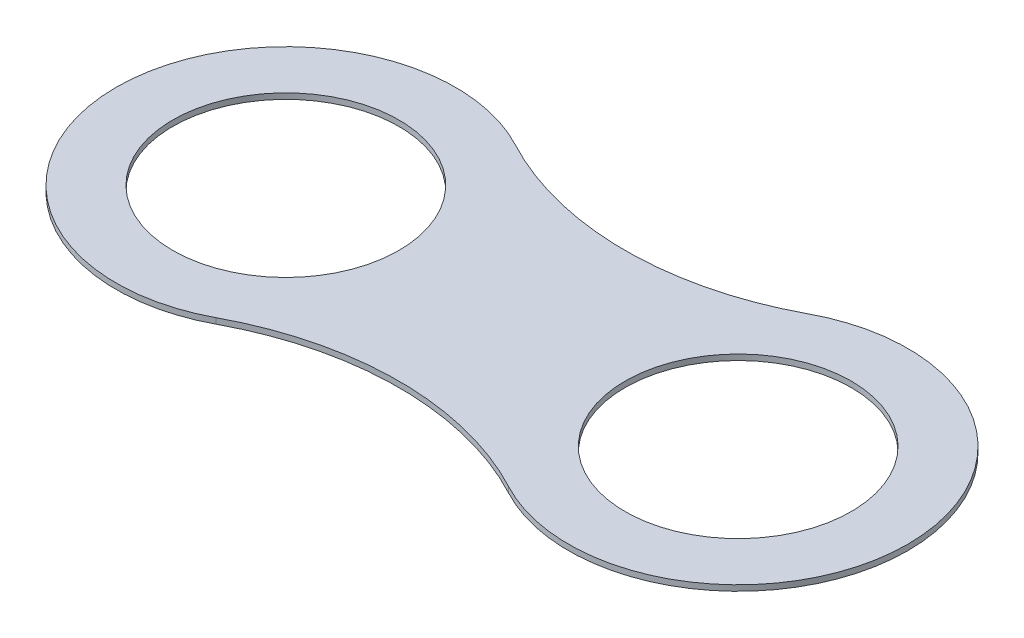
ISO-10303-21;
HEADER;
FILE_DESCRIPTION(('STEP AP214'),'2;1');
FILE_NAME('part.step','',(''),(''),'','','');
FILE_SCHEMA(('AUTOMOTIVE_DESIGN { 1 0 10303 214 1 1 1 1 }'));
ENDSEC;
DATA;
#1=APPLICATION_CONTEXT('core data for automotive mechanical design processes');
#2=APPLICATION_PROTOCOL_DEFINITION('international standard','automotive_design',2000,#1);
#3=PRODUCT_CONTEXT('',#1,'mechanical');
#4=PRODUCT('Part','Part','',(#3));
#5=PRODUCT_RELATED_PRODUCT_CATEGORY('part','',(#4));
#6=PRODUCT_DEFINITION_FORMATION('','',#4);
#7=PRODUCT_DEFINITION_CONTEXT('part definition',#1,'design');
#8=PRODUCT_DEFINITION('design','',#6,#7);
#9=PRODUCT_DEFINITION_SHAPE('','',#8);
#10=(LENGTH_UNIT() NAMED_UNIT(*) SI_UNIT(.MILLI.,.METRE.));
#11=(NAMED_UNIT(*) PLANE_ANGLE_UNIT() SI_UNIT($,.RADIAN.));
#12=(NAMED_UNIT(*) SI_UNIT($,.STERADIAN.) SOLID_ANGLE_UNIT());
#13=UNCERTAINTY_MEASURE_WITH_UNIT(LENGTH_MEASURE(1.E-05),#10,'distance_accuracy_value','');
#14=(GEOMETRIC_REPRESENTATION_CONTEXT(3) GLOBAL_UNCERTAINTY_ASSIGNED_CONTEXT((#13)) GLOBAL_UNIT_ASSIGNED_CONTEXT((#10,
#11,#12)) REPRESENTATION_CONTEXT('',''));
#15=CARTESIAN_POINT('',(0.,0.,0.));
#16=DIRECTION('',(0.,0.,1.));
#17=DIRECTION('',(1.,0.,0.));
#18=AXIS2_PLACEMENT_3D('',#15,#16,#17);
#19=CARTESIAN_POINT('',(600.,10.,-375.));
#20=DIRECTION('',(0.,1.,0.));
#21=DIRECTION('',(0.,0.,1.));
#22=AXIS2_PLACEMENT_3D('',#19,#20,#21);
#23=PLANE('',#22);
#24=CARTESIAN_POINT('',(0.,10.,0.));
#25=DIRECTION('',(0.,1.,0.));
#26=DIRECTION('',(0.,0.,1.));
#27=AXIS2_PLACEMENT_3D('',#24,#25,#26);
#28=CIRCLE('',#27,200.);
#29=CARTESIAN_POINT('',(0.,10.,200.));
#30=VERTEX_POINT('',#29);
#31=EDGE_CURVE('E98',#30,#30,#28,.T.);
#32=ORIENTED_EDGE('',*,*,#31,.F.);
#33=EDGE_LOOP('',(#32));
#34=FACE_BOUND('',#33,.T.);
#35=CARTESIAN_POINT('',(400.,10.,-750.));
#36=DIRECTION('',(0.,-1.,0.));
#37=DIRECTION('',(0.,0.,1.));
#38=AXIS2_PLACEMENT_3D('',#35,#36,#37);
#39=CIRCLE('',#38,550.);
#40=CARTESIAN_POINT('',(658.823529411765,10.,-264.705882352941));
#41=VERTEX_POINT('',#40);
#42=CARTESIAN_POINT('',(141.176470588235,10.,-264.705882352941));
#43=VERTEX_POINT('',#42);
#44=EDGE_CURVE('E83',#41,#43,#39,.T.);
#45=ORIENTED_EDGE('',*,*,#44,.T.);
#46=CARTESIAN_POINT('',(0.,10.,0.));
#47=DIRECTION('',(0.,1.,0.));
#48=DIRECTION('',(0.,0.,-1.));
#49=AXIS2_PLACEMENT_3D('',#46,#47,#48);
#50=CIRCLE('',#49,300.);
#51=CARTESIAN_POINT('',(141.176470588235,10.,264.705882352941));
#52=VERTEX_POINT('',#51);
#53=EDGE_CURVE('E78',#43,#52,#50,.T.);
#54=ORIENTED_EDGE('',*,*,#53,.T.);
#55=CARTESIAN_POINT('',(400.,10.,750.));
#56=DIRECTION('',(0.,-1.,0.));
#57=DIRECTION('',(0.,0.,-1.));
#58=AXIS2_PLACEMENT_3D('',#55,#56,#57);
#59=CIRCLE('',#58,550.);
#60=CARTESIAN_POINT('',(658.823529411765,10.,264.705882352941));
#61=VERTEX_POINT('',#60);
#62=EDGE_CURVE('E81',#52,#61,#59,.T.);
#63=ORIENTED_EDGE('',*,*,#62,.T.);
#64=CARTESIAN_POINT('',(800.,10.,0.));
#65=DIRECTION('',(0.,1.,0.));
#66=DIRECTION('',(0.,0.,1.));
#67=AXIS2_PLACEMENT_3D('',#64,#65,#66);
#68=CIRCLE('',#67,300.);
#69=EDGE_CURVE('E48',#61,#41,#68,.T.);
#70=ORIENTED_EDGE('',*,*,#69,.T.);
#71=EDGE_LOOP('',(#45,#54,#63,#70));
#72=FACE_BOUND('',#71,.T.);
#73=CARTESIAN_POINT('',(800.,10.,0.));
#74=DIRECTION('',(0.,1.,0.));
#75=DIRECTION('',(0.,0.,-1.));
#76=AXIS2_PLACEMENT_3D('',#73,#74,#75);
#77=CIRCLE('',#76,200.);
#78=CARTESIAN_POINT('',(800.,10.,-200.));
#79=VERTEX_POINT('',#78);
#80=EDGE_CURVE('E113',#79,#79,#77,.T.);
#81=ORIENTED_EDGE('',*,*,#80,.F.);
#82=EDGE_LOOP('',(#81));
#83=FACE_BOUND('',#82,.T.);
#84=ADVANCED_FACE('F31',(#34,#72,#83),#23,.T.);
#85=CARTESIAN_POINT('',(600.,0.,-375.));
#86=DIRECTION('',(0.,1.,0.));
#87=DIRECTION('',(0.,0.,1.));
#88=AXIS2_PLACEMENT_3D('',#85,#86,#87);
#89=PLANE('',#88);
#90=CARTESIAN_POINT('',(0.,0.,0.));
#91=DIRECTION('',(0.,1.,0.));
#92=DIRECTION('',(0.,0.,1.));
#93=AXIS2_PLACEMENT_3D('',#90,#91,#92);
#94=CIRCLE('',#93,200.);
#95=CARTESIAN_POINT('',(0.,0.,200.));
#96=VERTEX_POINT('',#95);
#97=EDGE_CURVE('E110',#96,#96,#94,.T.);
#98=ORIENTED_EDGE('',*,*,#97,.T.);
#99=EDGE_LOOP('',(#98));
#100=FACE_BOUND('',#99,.T.);
#101=CARTESIAN_POINT('',(400.,0.,-750.));
#102=DIRECTION('',(0.,-1.,0.));
#103=DIRECTION('',(0.,0.,1.));
#104=AXIS2_PLACEMENT_3D('',#101,#102,#103);
#105=CIRCLE('',#104,550.);
#106=CARTESIAN_POINT('',(658.823529411765,0.,-264.705882352941));
#107=VERTEX_POINT('',#106);
#108=CARTESIAN_POINT('',(141.176470588235,0.,-264.705882352941));
#109=VERTEX_POINT('',#108);
#110=EDGE_CURVE('E95',#107,#109,#105,.T.);
#111=ORIENTED_EDGE('',*,*,#110,.F.);
#112=CARTESIAN_POINT('',(800.,0.,0.));
#113=DIRECTION('',(0.,1.,0.));
#114=DIRECTION('',(0.,0.,1.));
#115=AXIS2_PLACEMENT_3D('',#112,#113,#114);
#116=CIRCLE('',#115,300.);
#117=CARTESIAN_POINT('',(658.823529411765,0.,264.705882352941));
#118=VERTEX_POINT('',#117);
#119=EDGE_CURVE('E71',#118,#107,#116,.T.);
#120=ORIENTED_EDGE('',*,*,#119,.F.);
#121=CARTESIAN_POINT('',(400.,0.,750.));
#122=DIRECTION('',(0.,-1.,0.));
#123=DIRECTION('',(0.,0.,-1.));
#124=AXIS2_PLACEMENT_3D('',#121,#122,#123);
#125=CIRCLE('',#124,550.);
#126=CARTESIAN_POINT('',(141.176470588235,0.,264.705882352941));
#127=VERTEX_POINT('',#126);
#128=EDGE_CURVE('E65',#127,#118,#125,.T.);
#129=ORIENTED_EDGE('',*,*,#128,.F.);
#130=CARTESIAN_POINT('',(0.,0.,0.));
#131=DIRECTION('',(0.,1.,0.));
#132=DIRECTION('',(0.,0.,-1.));
#133=AXIS2_PLACEMENT_3D('',#130,#131,#132);
#134=CIRCLE('',#133,300.);
#135=EDGE_CURVE('E87',#109,#127,#134,.T.);
#136=ORIENTED_EDGE('',*,*,#135,.F.);
#137=EDGE_LOOP('',(#111,#120,#129,#136));
#138=FACE_BOUND('',#137,.T.);
#139=CARTESIAN_POINT('',(800.,0.,0.));
#140=DIRECTION('',(0.,1.,0.));
#141=DIRECTION('',(0.,0.,-1.));
#142=AXIS2_PLACEMENT_3D('',#139,#140,#141);
#143=CIRCLE('',#142,200.);
#144=CARTESIAN_POINT('',(800.,0.,-200.));
#145=VERTEX_POINT('',#144);
#146=EDGE_CURVE('E116',#145,#145,#143,.T.);
#147=ORIENTED_EDGE('',*,*,#146,.T.);
#148=EDGE_LOOP('',(#147));
#149=FACE_BOUND('',#148,.T.);
#150=ADVANCED_FACE('F106',(#100,#138,#149),#89,.F.);
#151=CARTESIAN_POINT('',(400.,10.,-750.));
#152=DIRECTION('',(0.,-1.,0.));
#153=DIRECTION('',(0.,0.,-1.));
#154=AXIS2_PLACEMENT_3D('',#151,#152,#153);
#155=CYLINDRICAL_SURFACE('',#154,550.);
#156=ORIENTED_EDGE('',*,*,#110,.T.);
#157=DIRECTION('',(0.,-1.,0.));
#158=VECTOR('',#157,1.);
#159=CARTESIAN_POINT('',(141.176470588235,10.,-264.705882352941));
#160=LINE('',#159,#158);
#161=EDGE_CURVE('E11',#43,#109,#160,.T.);
#162=ORIENTED_EDGE('',*,*,#161,.F.);
#163=ORIENTED_EDGE('',*,*,#44,.F.);
#164=DIRECTION('',(0.,-1.,0.));
#165=VECTOR('',#164,1.);
#166=CARTESIAN_POINT('',(658.823529411765,10.,-264.705882352941));
#167=LINE('',#166,#165);
#168=EDGE_CURVE('E91',#41,#107,#167,.T.);
#169=ORIENTED_EDGE('',*,*,#168,.T.);
#170=EDGE_LOOP('',(#156,#162,#163,#169));
#171=FACE_BOUND('',#170,.T.);
#172=ADVANCED_FACE('F33',(#171),#155,.F.);
#173=CARTESIAN_POINT('',(0.,10.,0.));
#174=DIRECTION('',(0.,-1.,0.));
#175=DIRECTION('',(0.,0.,-1.));
#176=AXIS2_PLACEMENT_3D('',#173,#174,#175);
#177=CYLINDRICAL_SURFACE('',#176,300.);
#178=ORIENTED_EDGE('',*,*,#135,.T.);
#179=DIRECTION('',(0.,-1.,0.));
#180=VECTOR('',#179,1.);
#181=CARTESIAN_POINT('',(141.176470588235,10.,264.705882352941));
#182=LINE('',#181,#180);
#183=EDGE_CURVE('E40',#52,#127,#182,.T.);
#184=ORIENTED_EDGE('',*,*,#183,.F.);
#185=ORIENTED_EDGE('',*,*,#53,.F.);
#186=ORIENTED_EDGE('',*,*,#161,.T.);
#187=EDGE_LOOP('',(#178,#184,#185,#186));
#188=FACE_BOUND('',#187,.T.);
#189=ADVANCED_FACE('F86',(#188),#177,.T.);
#190=CARTESIAN_POINT('',(400.,10.,750.));
#191=DIRECTION('',(0.,-1.,0.));
#192=DIRECTION('',(0.,0.,-1.));
#193=AXIS2_PLACEMENT_3D('',#190,#191,#192);
#194=CYLINDRICAL_SURFACE('',#193,550.);
#195=ORIENTED_EDGE('',*,*,#128,.T.);
#196=DIRECTION('',(0.,-1.,0.));
#197=VECTOR('',#196,1.);
#198=CARTESIAN_POINT('',(658.823529411765,10.,264.705882352941));
#199=LINE('',#198,#197);
#200=EDGE_CURVE('E88',#61,#118,#199,.T.);
#201=ORIENTED_EDGE('',*,*,#200,.F.);
#202=ORIENTED_EDGE('',*,*,#62,.F.);
#203=ORIENTED_EDGE('',*,*,#183,.T.);
#204=EDGE_LOOP('',(#195,#201,#202,#203));
#205=FACE_BOUND('',#204,.T.);
#206=ADVANCED_FACE('F89',(#205),#194,.F.);
#207=CARTESIAN_POINT('',(800.,10.,0.));
#208=DIRECTION('',(0.,-1.,0.));
#209=DIRECTION('',(0.,0.,-1.));
#210=AXIS2_PLACEMENT_3D('',#207,#208,#209);
#211=CYLINDRICAL_SURFACE('',#210,300.);
#212=ORIENTED_EDGE('',*,*,#119,.T.);
#213=ORIENTED_EDGE('',*,*,#168,.F.);
#214=ORIENTED_EDGE('',*,*,#69,.F.);
#215=ORIENTED_EDGE('',*,*,#200,.T.);
#216=EDGE_LOOP('',(#212,#213,#214,#215));
#217=FACE_BOUND('',#216,.T.);
#218=ADVANCED_FACE('F103',(#217),#211,.T.);
#219=CARTESIAN_POINT('',(0.,10.,0.));
#220=DIRECTION('',(0.,-1.,0.));
#221=DIRECTION('',(0.,0.,-1.));
#222=AXIS2_PLACEMENT_3D('',#219,#220,#221);
#223=CYLINDRICAL_SURFACE('',#222,200.);
#224=ORIENTED_EDGE('',*,*,#31,.T.);
#225=EDGE_LOOP('',(#224));
#226=FACE_BOUND('',#225,.T.);
#227=ORIENTED_EDGE('',*,*,#97,.F.);
#228=EDGE_LOOP('',(#227));
#229=FACE_BOUND('',#228,.T.);
#230=ADVANCED_FACE('F134',(#226,#229),#223,.F.);
#231=CARTESIAN_POINT('',(800.,10.,0.));
#232=DIRECTION('',(0.,-1.,0.));
#233=DIRECTION('',(0.,0.,-1.));
#234=AXIS2_PLACEMENT_3D('',#231,#232,#233);
#235=CYLINDRICAL_SURFACE('',#234,200.);
#236=ORIENTED_EDGE('',*,*,#80,.T.);
#237=EDGE_LOOP('',(#236));
#238=FACE_BOUND('',#237,.T.);
#239=ORIENTED_EDGE('',*,*,#146,.F.);
#240=EDGE_LOOP('',(#239));
#241=FACE_BOUND('',#240,.T.);
#242=ADVANCED_FACE('F122',(#238,#241),#235,.F.);
#243=CLOSED_SHELL('',(#84,#150,#172,#189,#206,#218,#230,#242));
#244=MANIFOLD_SOLID_BREP('B2',#243);
#245=ADVANCED_BREP_SHAPE_REPRESENTATION('',(#18,#244),#14);
#246=SHAPE_DEFINITION_REPRESENTATION(#9,#245);
ENDSEC;
END-ISO-10303-21;
